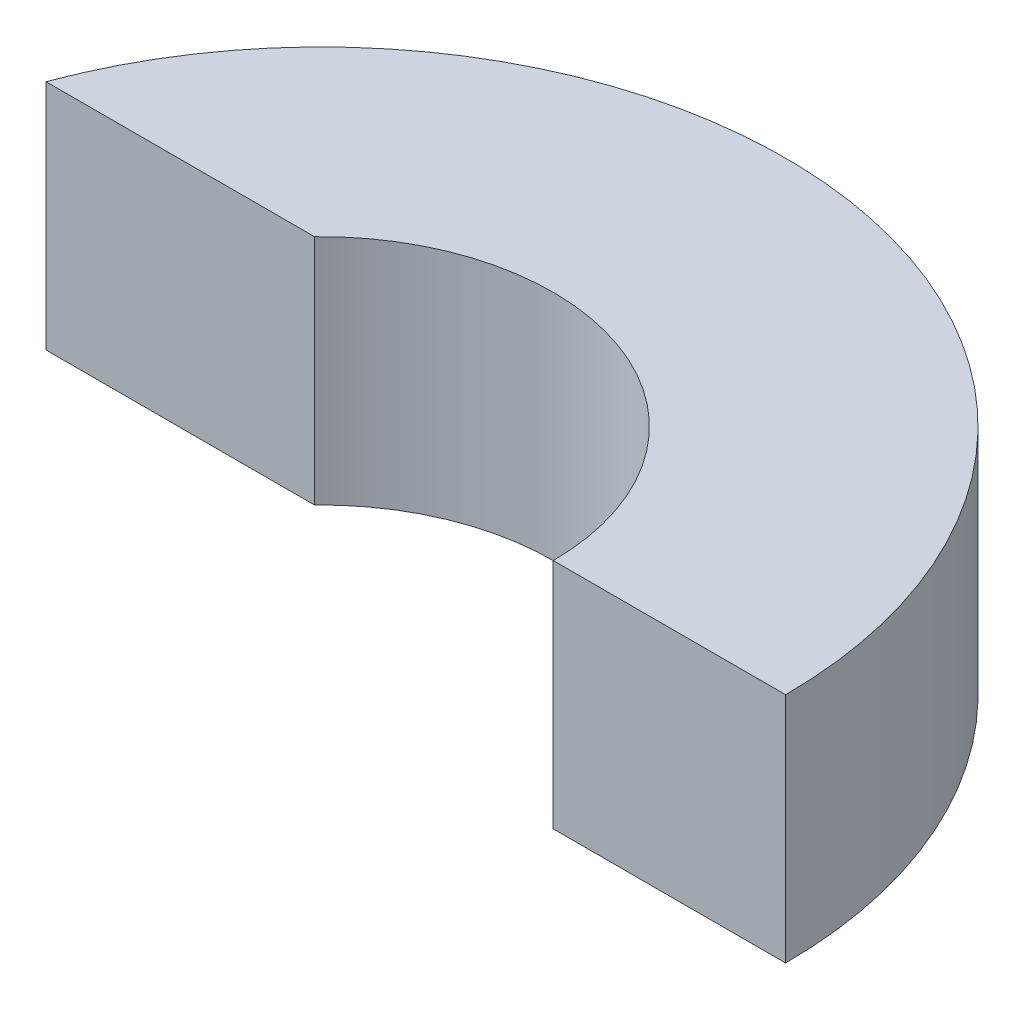
ISO-10303-21;
HEADER;
FILE_DESCRIPTION(('STEP AP214'),'2;1');
FILE_NAME('part.step','',(''),(''),'','','');
FILE_SCHEMA(('AUTOMOTIVE_DESIGN { 1 0 10303 214 1 1 1 1 }'));
ENDSEC;
DATA;
#1=APPLICATION_CONTEXT('core data for automotive mechanical design processes');
#2=APPLICATION_PROTOCOL_DEFINITION('international standard','automotive_design',2000,#1);
#3=PRODUCT_CONTEXT('',#1,'mechanical');
#4=PRODUCT('Part','Part','',(#3));
#5=PRODUCT_RELATED_PRODUCT_CATEGORY('part','',(#4));
#6=PRODUCT_DEFINITION_FORMATION('','',#4);
#7=PRODUCT_DEFINITION_CONTEXT('part definition',#1,'design');
#8=PRODUCT_DEFINITION('design','',#6,#7);
#9=PRODUCT_DEFINITION_SHAPE('','',#8);
#10=(LENGTH_UNIT() NAMED_UNIT(*) SI_UNIT(.MILLI.,.METRE.));
#11=(NAMED_UNIT(*) PLANE_ANGLE_UNIT() SI_UNIT($,.RADIAN.));
#12=(NAMED_UNIT(*) SI_UNIT($,.STERADIAN.) SOLID_ANGLE_UNIT());
#13=UNCERTAINTY_MEASURE_WITH_UNIT(LENGTH_MEASURE(1.E-05),#10,'distance_accuracy_value','');
#14=(GEOMETRIC_REPRESENTATION_CONTEXT(3) GLOBAL_UNCERTAINTY_ASSIGNED_CONTEXT((#13)) GLOBAL_UNIT_ASSIGNED_CONTEXT((#10,
#11,#12)) REPRESENTATION_CONTEXT('',''));
#15=CARTESIAN_POINT('',(0.,0.,0.));
#16=DIRECTION('',(0.,0.,1.));
#17=DIRECTION('',(1.,0.,0.));
#18=AXIS2_PLACEMENT_3D('',#15,#16,#17);
#19=CARTESIAN_POINT('',(0.,5.,0.));
#20=DIRECTION('',(0.,-1.,0.));
#21=DIRECTION('',(0.,0.,-1.));
#22=AXIS2_PLACEMENT_3D('',#19,#20,#21);
#23=CYLINDRICAL_SURFACE('',#22,5.);
#24=CARTESIAN_POINT('',(0.,0.,0.));
#25=DIRECTION('',(0.,-1.,0.));
#26=DIRECTION('',(0.,0.,1.));
#27=AXIS2_PLACEMENT_3D('',#24,#25,#26);
#28=CIRCLE('',#27,5.);
#29=CARTESIAN_POINT('',(-3.60323787706797,0.,-3.46650786833994));
#30=VERTEX_POINT('',#29);
#31=CARTESIAN_POINT('',(5.,0.,0.));
#32=VERTEX_POINT('',#31);
#33=EDGE_CURVE('E96',#30,#32,#28,.T.);
#34=ORIENTED_EDGE('',*,*,#33,.T.);
#35=DIRECTION('',(0.,-1.,0.));
#36=VECTOR('',#35,1.);
#37=CARTESIAN_POINT('',(5.,5.,0.));
#38=LINE('',#37,#36);
#39=CARTESIAN_POINT('',(5.,5.,0.));
#40=VERTEX_POINT('',#39);
#41=EDGE_CURVE('E11',#40,#32,#38,.T.);
#42=ORIENTED_EDGE('',*,*,#41,.F.);
#43=CARTESIAN_POINT('',(0.,5.,0.));
#44=DIRECTION('',(0.,-1.,0.));
#45=DIRECTION('',(0.,0.,1.));
#46=AXIS2_PLACEMENT_3D('',#43,#44,#45);
#47=CIRCLE('',#46,5.);
#48=CARTESIAN_POINT('',(-3.60323787706797,5.,-3.46650786833994));
#49=VERTEX_POINT('',#48);
#50=EDGE_CURVE('E84',#49,#40,#47,.T.);
#51=ORIENTED_EDGE('',*,*,#50,.F.);
#52=DIRECTION('',(0.,-1.,0.));
#53=VECTOR('',#52,1.);
#54=CARTESIAN_POINT('',(-3.60323787706797,5.,-3.46650786833994));
#55=LINE('',#54,#53);
#56=EDGE_CURVE('E92',#49,#30,#55,.T.);
#57=ORIENTED_EDGE('',*,*,#56,.T.);
#58=EDGE_LOOP('',(#34,#42,#51,#57));
#59=FACE_BOUND('',#58,.T.);
#60=ADVANCED_FACE('F33',(#59),#23,.F.);
#61=CARTESIAN_POINT('',(5.,5.,0.));
#62=DIRECTION('',(0.,0.,-1.));
#63=DIRECTION('',(-1.,0.,0.));
#64=AXIS2_PLACEMENT_3D('',#61,#62,#63);
#65=PLANE('',#64);
#66=DIRECTION('',(1.,0.,0.));
#67=VECTOR('',#66,1.);
#68=CARTESIAN_POINT('',(5.,0.,0.));
#69=LINE('',#68,#67);
#70=CARTESIAN_POINT('',(10.,0.,0.));
#71=VERTEX_POINT('',#70);
#72=EDGE_CURVE('E88',#32,#71,#69,.T.);
#73=ORIENTED_EDGE('',*,*,#72,.T.);
#74=DIRECTION('',(0.,-1.,0.));
#75=VECTOR('',#74,1.);
#76=CARTESIAN_POINT('',(10.,5.,0.));
#77=LINE('',#76,#75);
#78=CARTESIAN_POINT('',(10.,5.,0.));
#79=VERTEX_POINT('',#78);
#80=EDGE_CURVE('E41',#79,#71,#77,.T.);
#81=ORIENTED_EDGE('',*,*,#80,.F.);
#82=DIRECTION('',(1.,0.,0.));
#83=VECTOR('',#82,1.);
#84=CARTESIAN_POINT('',(5.,5.,0.));
#85=LINE('',#84,#83);
#86=EDGE_CURVE('E79',#40,#79,#85,.T.);
#87=ORIENTED_EDGE('',*,*,#86,.F.);
#88=ORIENTED_EDGE('',*,*,#41,.T.);
#89=EDGE_LOOP('',(#73,#81,#87,#88));
#90=FACE_BOUND('',#89,.T.);
#91=ADVANCED_FACE('F87',(#90),#65,.F.);
#92=CARTESIAN_POINT('',(0.,5.,0.));
#93=DIRECTION('',(0.,-1.,0.));
#94=DIRECTION('',(0.,0.,-1.));
#95=AXIS2_PLACEMENT_3D('',#92,#93,#94);
#96=CYLINDRICAL_SURFACE('',#95,10.);
#97=CARTESIAN_POINT('',(0.,0.,0.));
#98=DIRECTION('',(0.,1.,0.));
#99=DIRECTION('',(0.,0.,1.));
#100=AXIS2_PLACEMENT_3D('',#97,#98,#99);
#101=CIRCLE('',#100,10.);
#102=CARTESIAN_POINT('',(-9.37994260103639,0.,-3.46650786833994));
#103=VERTEX_POINT('',#102);
#104=EDGE_CURVE('E66',#71,#103,#101,.T.);
#105=ORIENTED_EDGE('',*,*,#104,.T.);
#106=DIRECTION('',(0.,-1.,0.));
#107=VECTOR('',#106,1.);
#108=CARTESIAN_POINT('',(-9.37994260103639,5.,-3.46650786833994));
#109=LINE('',#108,#107);
#110=CARTESIAN_POINT('',(-9.37994260103639,5.,-3.46650786833994));
#111=VERTEX_POINT('',#110);
#112=EDGE_CURVE('E89',#111,#103,#109,.T.);
#113=ORIENTED_EDGE('',*,*,#112,.F.);
#114=CARTESIAN_POINT('',(0.,5.,0.));
#115=DIRECTION('',(0.,1.,0.));
#116=DIRECTION('',(0.,0.,1.));
#117=AXIS2_PLACEMENT_3D('',#114,#115,#116);
#118=CIRCLE('',#117,10.);
#119=EDGE_CURVE('E82',#79,#111,#118,.T.);
#120=ORIENTED_EDGE('',*,*,#119,.F.);
#121=ORIENTED_EDGE('',*,*,#80,.T.);
#122=EDGE_LOOP('',(#105,#113,#120,#121));
#123=FACE_BOUND('',#122,.T.);
#124=ADVANCED_FACE('F90',(#123),#96,.T.);
#125=CARTESIAN_POINT('',(-3.60323787706797,5.,-3.46650786833994));
#126=DIRECTION('',(0.,0.,-1.));
#127=DIRECTION('',(-1.,0.,0.));
#128=AXIS2_PLACEMENT_3D('',#125,#126,#127);
#129=PLANE('',#128);
#130=DIRECTION('',(1.,0.,0.));
#131=VECTOR('',#130,1.);
#132=CARTESIAN_POINT('',(-3.60323787706797,0.,-3.46650786833994));
#133=LINE('',#132,#131);
#134=EDGE_CURVE('E72',#103,#30,#133,.T.);
#135=ORIENTED_EDGE('',*,*,#134,.T.);
#136=ORIENTED_EDGE('',*,*,#56,.F.);
#137=DIRECTION('',(1.,0.,0.));
#138=VECTOR('',#137,1.);
#139=CARTESIAN_POINT('',(-3.60323787706797,5.,-3.46650786833994));
#140=LINE('',#139,#138);
#141=EDGE_CURVE('E49',#111,#49,#140,.T.);
#142=ORIENTED_EDGE('',*,*,#141,.F.);
#143=ORIENTED_EDGE('',*,*,#112,.T.);
#144=EDGE_LOOP('',(#135,#136,#142,#143));
#145=FACE_BOUND('',#144,.T.);
#146=ADVANCED_FACE('F103',(#145),#129,.F.);
#147=CARTESIAN_POINT('',(0.,5.,0.));
#148=DIRECTION('',(0.,1.,0.));
#149=DIRECTION('',(0.,0.,1.));
#150=AXIS2_PLACEMENT_3D('',#147,#148,#149);
#151=PLANE('',#150);
#152=ORIENTED_EDGE('',*,*,#50,.T.);
#153=ORIENTED_EDGE('',*,*,#86,.T.);
#154=ORIENTED_EDGE('',*,*,#119,.T.);
#155=ORIENTED_EDGE('',*,*,#141,.T.);
#156=EDGE_LOOP('',(#152,#153,#154,#155));
#157=FACE_BOUND('',#156,.T.);
#158=ADVANCED_FACE('F80',(#157),#151,.T.);
#159=CARTESIAN_POINT('',(0.,0.,0.));
#160=DIRECTION('',(0.,1.,0.));
#161=DIRECTION('',(0.,0.,1.));
#162=AXIS2_PLACEMENT_3D('',#159,#160,#161);
#163=PLANE('',#162);
#164=ORIENTED_EDGE('',*,*,#33,.F.);
#165=ORIENTED_EDGE('',*,*,#134,.F.);
#166=ORIENTED_EDGE('',*,*,#104,.F.);
#167=ORIENTED_EDGE('',*,*,#72,.F.);
#168=EDGE_LOOP('',(#164,#165,#166,#167));
#169=FACE_BOUND('',#168,.T.);
#170=ADVANCED_FACE('F106',(#169),#163,.F.);
#171=CLOSED_SHELL('',(#60,#91,#124,#146,#158,#170));
#172=MANIFOLD_SOLID_BREP('B2',#171);
#173=ADVANCED_BREP_SHAPE_REPRESENTATION('',(#18,#172),#14);
#174=SHAPE_DEFINITION_REPRESENTATION(#9,#173);
ENDSEC;
END-ISO-10303-21;
